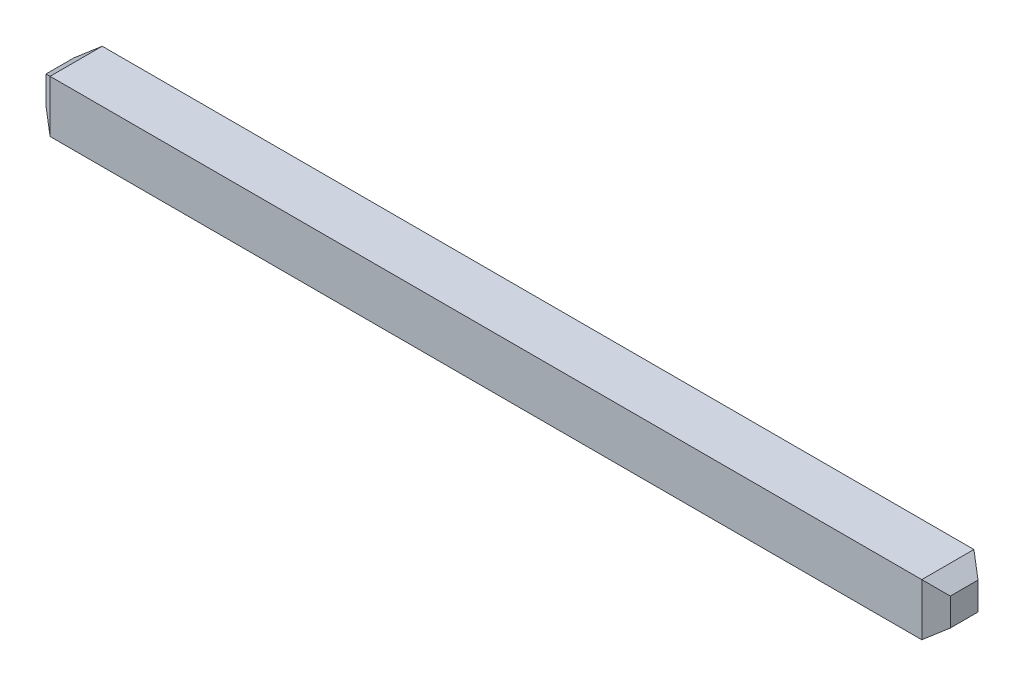
ISO-10303-21;
HEADER;
FILE_DESCRIPTION(('STEP AP214'),'2;1');
FILE_NAME('part.step','',(''),(''),'','','');
FILE_SCHEMA(('AUTOMOTIVE_DESIGN { 1 0 10303 214 1 1 1 1 }'));
ENDSEC;
DATA;
#1=APPLICATION_CONTEXT('core data for automotive mechanical design processes');
#2=APPLICATION_PROTOCOL_DEFINITION('international standard','automotive_design',2000,#1);
#3=PRODUCT_CONTEXT('',#1,'mechanical');
#4=PRODUCT('Part','Part','',(#3));
#5=PRODUCT_RELATED_PRODUCT_CATEGORY('part','',(#4));
#6=PRODUCT_DEFINITION_FORMATION('','',#4);
#7=PRODUCT_DEFINITION_CONTEXT('part definition',#1,'design');
#8=PRODUCT_DEFINITION('design','',#6,#7);
#9=PRODUCT_DEFINITION_SHAPE('','',#8);
#10=(LENGTH_UNIT() NAMED_UNIT(*) SI_UNIT(.MILLI.,.METRE.));
#11=(NAMED_UNIT(*) PLANE_ANGLE_UNIT() SI_UNIT($,.RADIAN.));
#12=(NAMED_UNIT(*) SI_UNIT($,.STERADIAN.) SOLID_ANGLE_UNIT());
#13=UNCERTAINTY_MEASURE_WITH_UNIT(LENGTH_MEASURE(1.E-05),#10,'distance_accuracy_value','');
#14=(GEOMETRIC_REPRESENTATION_CONTEXT(3) GLOBAL_UNCERTAINTY_ASSIGNED_CONTEXT((#13)) GLOBAL_UNIT_ASSIGNED_CONTEXT((#10,
#11,#12)) REPRESENTATION_CONTEXT('',''));
#15=CARTESIAN_POINT('',(0.,0.,0.));
#16=DIRECTION('',(0.,0.,1.));
#17=DIRECTION('',(1.,0.,0.));
#18=AXIS2_PLACEMENT_3D('',#15,#16,#17);
#19=CARTESIAN_POINT('',(-2.4,3.77,-29.455));
#20=DIRECTION('',(0.5999999999908,0.,0.8000000000069));
#21=DIRECTION('',(0.8000000000069,0.,-0.5999999999908));
#22=AXIS2_PLACEMENT_3D('',#19,#20,#21);
#23=PLANE('',#22);
#24=DIRECTION('',(0.,1.,0.));
#25=VECTOR('',#24,1.);
#26=CARTESIAN_POINT('',(-2.3,3.77,-29.53));
#27=LINE('',#26,#25);
#28=CARTESIAN_POINT('',(-2.29999999999957,4.09,-29.5299999999994));
#29=VERTEX_POINT('',#28);
#30=CARTESIAN_POINT('',(-2.29999999999957,3.45,-29.5299999999994));
#31=VERTEX_POINT('',#30);
#32=EDGE_CURVE('E101',#29,#31,#27,.F.);
#33=ORIENTED_EDGE('',*,*,#32,.T.);
#34=DIRECTION('',(-0.685994340570035,0.514495755427526,0.514495755427529));
#35=VECTOR('',#34,1.);
#36=CARTESIAN_POINT('',(-2.3,3.45,-29.53));
#37=LINE('',#36,#35);
#38=CARTESIAN_POINT('',(-2.50000000000022,3.6,-29.3800000000003));
#39=VERTEX_POINT('',#38);
#40=EDGE_CURVE('E85',#31,#39,#37,.T.);
#41=ORIENTED_EDGE('',*,*,#40,.T.);
#42=DIRECTION('',(0.,1.,0.));
#43=VECTOR('',#42,1.);
#44=CARTESIAN_POINT('',(-2.5,3.77,-29.38));
#45=LINE('',#44,#43);
#46=CARTESIAN_POINT('',(-2.50000000000043,3.94,-29.3800000000006));
#47=VERTEX_POINT('',#46);
#48=EDGE_CURVE('E79',#39,#47,#45,.T.);
#49=ORIENTED_EDGE('',*,*,#48,.T.);
#50=DIRECTION('',(-0.685994340570035,-0.514495755427526,0.514495755427529));
#51=VECTOR('',#50,1.);
#52=CARTESIAN_POINT('',(-2.3,4.09,-29.53));
#53=LINE('',#52,#51);
#54=EDGE_CURVE('E20',#29,#47,#53,.T.);
#55=ORIENTED_EDGE('',*,*,#54,.F.);
#56=EDGE_LOOP('',(#33,#41,#49,#55));
#57=FACE_BOUND('',#56,.T.);
#58=ADVANCED_FACE('F17',(#57),#23,.F.);
#59=CARTESIAN_POINT('',(8.5,3.77,-29.455));
#60=DIRECTION('',(-0.5999999999908,0.,0.8000000000069));
#61=DIRECTION('',(0.8000000000069,0.,0.5999999999908));
#62=AXIS2_PLACEMENT_3D('',#59,#60,#61);
#63=PLANE('',#62);
#64=DIRECTION('',(0.,1.,0.));
#65=VECTOR('',#64,1.);
#66=CARTESIAN_POINT('',(8.6,3.77,-29.38));
#67=LINE('',#66,#65);
#68=CARTESIAN_POINT('',(8.60000000000021,3.6,-29.3800000000003));
#69=VERTEX_POINT('',#68);
#70=CARTESIAN_POINT('',(8.60000000000043,3.94,-29.3800000000006));
#71=VERTEX_POINT('',#70);
#72=EDGE_CURVE('E113',#69,#71,#67,.T.);
#73=ORIENTED_EDGE('',*,*,#72,.F.);
#74=DIRECTION('',(-0.685994340570033,-0.514495755427525,-0.514495755427531));
#75=VECTOR('',#74,1.);
#76=CARTESIAN_POINT('',(8.6,3.6,-29.38));
#77=LINE('',#76,#75);
#78=CARTESIAN_POINT('',(8.39999999999957,3.45,-29.5299999999994));
#79=VERTEX_POINT('',#78);
#80=EDGE_CURVE('E108',#69,#79,#77,.T.);
#81=ORIENTED_EDGE('',*,*,#80,.T.);
#82=DIRECTION('',(0.,1.,0.));
#83=VECTOR('',#82,1.);
#84=CARTESIAN_POINT('',(8.4,3.77,-29.53));
#85=LINE('',#84,#83);
#86=CARTESIAN_POINT('',(8.39999999999957,4.09,-29.5299999999994));
#87=VERTEX_POINT('',#86);
#88=EDGE_CURVE('E99',#79,#87,#85,.T.);
#89=ORIENTED_EDGE('',*,*,#88,.T.);
#90=DIRECTION('',(-0.685994340570033,0.514495755427525,-0.514495755427531));
#91=VECTOR('',#90,1.);
#92=CARTESIAN_POINT('',(8.6,3.94,-29.38));
#93=LINE('',#92,#91);
#94=EDGE_CURVE('E116',#71,#87,#93,.T.);
#95=ORIENTED_EDGE('',*,*,#94,.F.);
#96=EDGE_LOOP('',(#73,#81,#89,#95));
#97=FACE_BOUND('',#96,.T.);
#98=ADVANCED_FACE('F214',(#97),#63,.F.);
#99=CARTESIAN_POINT('',(-2.4,4.015,-29.21));
#100=DIRECTION('',(-0.6,0.8,0.));
#101=DIRECTION('',(-0.8,-0.6,0.));
#102=AXIS2_PLACEMENT_3D('',#99,#100,#101);
#103=PLANE('',#102);
#104=DIRECTION('',(-0.685994340575992,-0.514495755427529,-0.514495755419582));
#105=VECTOR('',#104,1.);
#106=CARTESIAN_POINT('',(-2.29999999999913,4.09,-28.8900000000012));
#107=LINE('',#106,#105);
#108=CARTESIAN_POINT('',(-2.29999999999989,4.09,-28.8900000000001));
#109=VERTEX_POINT('',#108);
#110=CARTESIAN_POINT('',(-2.50000000000022,3.94,-29.0399999999997));
#111=VERTEX_POINT('',#110);
#112=EDGE_CURVE('E128',#109,#111,#107,.T.);
#113=ORIENTED_EDGE('',*,*,#112,.F.);
#114=DIRECTION('',(0.,0.,1.));
#115=VECTOR('',#114,1.);
#116=CARTESIAN_POINT('',(-2.3,4.09,-29.21));
#117=LINE('',#116,#115);
#118=EDGE_CURVE('E93',#29,#109,#117,.T.);
#119=ORIENTED_EDGE('',*,*,#118,.F.);
#120=ORIENTED_EDGE('',*,*,#54,.T.);
#121=DIRECTION('',(0.,0.,-1.));
#122=VECTOR('',#121,1.);
#123=CARTESIAN_POINT('',(-2.5,3.94,-29.21));
#124=LINE('',#123,#122);
#125=EDGE_CURVE('E87',#47,#111,#124,.F.);
#126=ORIENTED_EDGE('',*,*,#125,.T.);
#127=EDGE_LOOP('',(#113,#119,#120,#126));
#128=FACE_BOUND('',#127,.T.);
#129=ADVANCED_FACE('F90',(#128),#103,.T.);
#130=CARTESIAN_POINT('',(-2.5,3.77,-29.21));
#131=DIRECTION('',(1.,0.,0.));
#132=DIRECTION('',(0.,0.,-1.));
#133=AXIS2_PLACEMENT_3D('',#130,#131,#132);
#134=PLANE('',#133);
#135=DIRECTION('',(0.,1.,0.));
#136=VECTOR('',#135,1.);
#137=CARTESIAN_POINT('',(-2.50000000000087,3.77,-29.0399999999988));
#138=LINE('',#137,#136);
#139=CARTESIAN_POINT('',(-2.50000000000022,3.6,-29.0399999999997));
#140=VERTEX_POINT('',#139);
#141=EDGE_CURVE('E97',#111,#140,#138,.F.);
#142=ORIENTED_EDGE('',*,*,#141,.F.);
#143=ORIENTED_EDGE('',*,*,#125,.F.);
#144=ORIENTED_EDGE('',*,*,#48,.F.);
#145=DIRECTION('',(0.,0.,1.));
#146=VECTOR('',#145,1.);
#147=CARTESIAN_POINT('',(-2.5,3.6,-29.21));
#148=LINE('',#147,#146);
#149=EDGE_CURVE('E105',#39,#140,#148,.T.);
#150=ORIENTED_EDGE('',*,*,#149,.T.);
#151=EDGE_LOOP('',(#142,#143,#144,#150));
#152=FACE_BOUND('',#151,.T.);
#153=ADVANCED_FACE('F95',(#152),#134,.F.);
#154=CARTESIAN_POINT('',(3.05,3.77,-29.53));
#155=DIRECTION('',(0.,0.,1.));
#156=DIRECTION('',(1.,0.,0.));
#157=AXIS2_PLACEMENT_3D('',#154,#155,#156);
#158=PLANE('',#157);
#159=ORIENTED_EDGE('',*,*,#32,.F.);
#160=DIRECTION('',(1.,0.,0.));
#161=VECTOR('',#160,1.);
#162=CARTESIAN_POINT('',(3.05,4.09,-29.53));
#163=LINE('',#162,#161);
#164=EDGE_CURVE('E122',#87,#29,#163,.F.);
#165=ORIENTED_EDGE('',*,*,#164,.F.);
#166=ORIENTED_EDGE('',*,*,#88,.F.);
#167=DIRECTION('',(1.,0.,0.));
#168=VECTOR('',#167,1.);
#169=CARTESIAN_POINT('',(3.05,3.45,-29.53));
#170=LINE('',#169,#168);
#171=EDGE_CURVE('E136',#79,#31,#170,.F.);
#172=ORIENTED_EDGE('',*,*,#171,.T.);
#173=EDGE_LOOP('',(#159,#165,#166,#172));
#174=FACE_BOUND('',#173,.T.);
#175=ADVANCED_FACE('F182',(#174),#158,.F.);
#176=CARTESIAN_POINT('',(-2.4,3.525,-29.21));
#177=DIRECTION('',(0.6,0.8,0.));
#178=DIRECTION('',(-0.8,0.6,0.));
#179=AXIS2_PLACEMENT_3D('',#176,#177,#178);
#180=PLANE('',#179);
#181=DIRECTION('',(0.,0.,1.));
#182=VECTOR('',#181,1.);
#183=CARTESIAN_POINT('',(-2.3,3.45,-29.21));
#184=LINE('',#183,#182);
#185=CARTESIAN_POINT('',(-2.29999999999978,3.45,-28.8900000000003));
#186=VERTEX_POINT('',#185);
#187=EDGE_CURVE('E139',#31,#186,#184,.T.);
#188=ORIENTED_EDGE('',*,*,#187,.T.);
#189=DIRECTION('',(0.685994340575992,-0.514495755427529,0.514495755419582));
#190=VECTOR('',#189,1.);
#191=CARTESIAN_POINT('',(-2.50000000000087,3.6,-29.0399999999988));
#192=LINE('',#191,#190);
#193=EDGE_CURVE('E131',#140,#186,#192,.T.);
#194=ORIENTED_EDGE('',*,*,#193,.F.);
#195=ORIENTED_EDGE('',*,*,#149,.F.);
#196=ORIENTED_EDGE('',*,*,#40,.F.);
#197=EDGE_LOOP('',(#188,#194,#195,#196));
#198=FACE_BOUND('',#197,.T.);
#199=ADVANCED_FACE('F179',(#198),#180,.F.);
#200=CARTESIAN_POINT('',(8.5,3.525,-29.21));
#201=DIRECTION('',(-0.6,0.8,0.));
#202=DIRECTION('',(-0.8,-0.6,0.));
#203=AXIS2_PLACEMENT_3D('',#200,#201,#202);
#204=PLANE('',#203);
#205=DIRECTION('',(0.,0.,-1.));
#206=VECTOR('',#205,1.);
#207=CARTESIAN_POINT('',(8.6,3.6,-29.21));
#208=LINE('',#207,#206);
#209=CARTESIAN_POINT('',(8.60000000000022,3.6,-29.0399999999997));
#210=VERTEX_POINT('',#209);
#211=EDGE_CURVE('E110',#210,#69,#208,.T.);
#212=ORIENTED_EDGE('',*,*,#211,.F.);
#213=DIRECTION('',(0.685994340575992,0.514495755427534,-0.514495755419576));
#214=VECTOR('',#213,1.);
#215=CARTESIAN_POINT('',(8.39999999999913,3.45,-28.8900000000012));
#216=LINE('',#215,#214);
#217=CARTESIAN_POINT('',(8.39999999999989,3.45,-28.8900000000001));
#218=VERTEX_POINT('',#217);
#219=EDGE_CURVE('E35',#218,#210,#216,.T.);
#220=ORIENTED_EDGE('',*,*,#219,.F.);
#221=DIRECTION('',(0.,0.,1.));
#222=VECTOR('',#221,1.);
#223=CARTESIAN_POINT('',(8.4,3.45,-29.21));
#224=LINE('',#223,#222);
#225=EDGE_CURVE('E134',#218,#79,#224,.F.);
#226=ORIENTED_EDGE('',*,*,#225,.T.);
#227=ORIENTED_EDGE('',*,*,#80,.F.);
#228=EDGE_LOOP('',(#212,#220,#226,#227));
#229=FACE_BOUND('',#228,.T.);
#230=ADVANCED_FACE('F181',(#229),#204,.F.);
#231=CARTESIAN_POINT('',(8.6,3.77,-29.21));
#232=DIRECTION('',(1.,0.,0.));
#233=DIRECTION('',(0.,0.,-1.));
#234=AXIS2_PLACEMENT_3D('',#231,#232,#233);
#235=PLANE('',#234);
#236=ORIENTED_EDGE('',*,*,#72,.T.);
#237=DIRECTION('',(0.,0.,1.));
#238=VECTOR('',#237,1.);
#239=CARTESIAN_POINT('',(8.6,3.94,-29.21));
#240=LINE('',#239,#238);
#241=CARTESIAN_POINT('',(8.60000000000022,3.94,-29.0399999999997));
#242=VERTEX_POINT('',#241);
#243=EDGE_CURVE('E119',#242,#71,#240,.F.);
#244=ORIENTED_EDGE('',*,*,#243,.F.);
#245=DIRECTION('',(0.,1.,0.));
#246=VECTOR('',#245,1.);
#247=CARTESIAN_POINT('',(8.60000000000087,3.77,-29.0399999999988));
#248=LINE('',#247,#246);
#249=EDGE_CURVE('E142',#210,#242,#248,.T.);
#250=ORIENTED_EDGE('',*,*,#249,.F.);
#251=ORIENTED_EDGE('',*,*,#211,.T.);
#252=EDGE_LOOP('',(#236,#244,#250,#251));
#253=FACE_BOUND('',#252,.T.);
#254=ADVANCED_FACE('F189',(#253),#235,.T.);
#255=CARTESIAN_POINT('',(8.5,4.015,-29.21));
#256=DIRECTION('',(0.6,0.8,0.));
#257=DIRECTION('',(-0.8,0.6,0.));
#258=AXIS2_PLACEMENT_3D('',#255,#256,#257);
#259=PLANE('',#258);
#260=DIRECTION('',(-0.685994340575992,0.514495755427534,0.514495755419576));
#261=VECTOR('',#260,1.);
#262=CARTESIAN_POINT('',(8.60000000000087,3.94,-29.0399999999988));
#263=LINE('',#262,#261);
#264=CARTESIAN_POINT('',(8.39999999999989,4.09,-28.8900000000001));
#265=VERTEX_POINT('',#264);
#266=EDGE_CURVE('E145',#242,#265,#263,.T.);
#267=ORIENTED_EDGE('',*,*,#266,.F.);
#268=ORIENTED_EDGE('',*,*,#243,.T.);
#269=ORIENTED_EDGE('',*,*,#94,.T.);
#270=DIRECTION('',(0.,0.,1.));
#271=VECTOR('',#270,1.);
#272=CARTESIAN_POINT('',(8.4,4.09,-29.21));
#273=LINE('',#272,#271);
#274=EDGE_CURVE('E125',#265,#87,#273,.F.);
#275=ORIENTED_EDGE('',*,*,#274,.F.);
#276=EDGE_LOOP('',(#267,#268,#269,#275));
#277=FACE_BOUND('',#276,.T.);
#278=ADVANCED_FACE('F170',(#277),#259,.T.);
#279=CARTESIAN_POINT('',(3.05,4.09,-29.21));
#280=DIRECTION('',(0.,1.,0.));
#281=DIRECTION('',(0.,0.,1.));
#282=AXIS2_PLACEMENT_3D('',#279,#280,#281);
#283=PLANE('',#282);
#284=DIRECTION('',(1.,0.,0.));
#285=VECTOR('',#284,1.);
#286=CARTESIAN_POINT('',(3.05,4.09,-28.89));
#287=LINE('',#286,#285);
#288=EDGE_CURVE('E148',#265,#109,#287,.F.);
#289=ORIENTED_EDGE('',*,*,#288,.F.);
#290=ORIENTED_EDGE('',*,*,#274,.T.);
#291=ORIENTED_EDGE('',*,*,#164,.T.);
#292=ORIENTED_EDGE('',*,*,#118,.T.);
#293=EDGE_LOOP('',(#289,#290,#291,#292));
#294=FACE_BOUND('',#293,.T.);
#295=ADVANCED_FACE('F173',(#294),#283,.T.);
#296=CARTESIAN_POINT('',(-2.4,3.77,-28.965));
#297=DIRECTION('',(-0.599999999990736,0.,0.800000000006948));
#298=DIRECTION('',(0.800000000006948,0.,0.599999999990736));
#299=AXIS2_PLACEMENT_3D('',#296,#297,#298);
#300=PLANE('',#299);
#301=ORIENTED_EDGE('',*,*,#193,.T.);
#302=DIRECTION('',(0.,1.,0.));
#303=VECTOR('',#302,1.);
#304=CARTESIAN_POINT('',(-2.3,3.77,-28.89));
#305=LINE('',#304,#303);
#306=EDGE_CURVE('E151',#109,#186,#305,.F.);
#307=ORIENTED_EDGE('',*,*,#306,.F.);
#308=ORIENTED_EDGE('',*,*,#112,.T.);
#309=ORIENTED_EDGE('',*,*,#141,.T.);
#310=EDGE_LOOP('',(#301,#307,#308,#309));
#311=FACE_BOUND('',#310,.T.);
#312=ADVANCED_FACE('F176',(#311),#300,.T.);
#313=CARTESIAN_POINT('',(3.05,3.45,-29.21));
#314=DIRECTION('',(0.,1.,0.));
#315=DIRECTION('',(0.,0.,1.));
#316=AXIS2_PLACEMENT_3D('',#313,#314,#315);
#317=PLANE('',#316);
#318=ORIENTED_EDGE('',*,*,#187,.F.);
#319=ORIENTED_EDGE('',*,*,#171,.F.);
#320=ORIENTED_EDGE('',*,*,#225,.F.);
#321=DIRECTION('',(1.,0.,0.));
#322=VECTOR('',#321,1.);
#323=CARTESIAN_POINT('',(3.05,3.45,-28.89));
#324=LINE('',#323,#322);
#325=EDGE_CURVE('E26',#186,#218,#324,.T.);
#326=ORIENTED_EDGE('',*,*,#325,.F.);
#327=EDGE_LOOP('',(#318,#319,#320,#326));
#328=FACE_BOUND('',#327,.T.);
#329=ADVANCED_FACE('F162',(#328),#317,.F.);
#330=CARTESIAN_POINT('',(8.5,3.77,-28.965));
#331=DIRECTION('',(0.599999999990736,0.,0.800000000006948));
#332=DIRECTION('',(0.800000000006948,0.,-0.599999999990736));
#333=AXIS2_PLACEMENT_3D('',#330,#331,#332);
#334=PLANE('',#333);
#335=ORIENTED_EDGE('',*,*,#266,.T.);
#336=DIRECTION('',(0.,1.,0.));
#337=VECTOR('',#336,1.);
#338=CARTESIAN_POINT('',(8.4,3.77,-28.89));
#339=LINE('',#338,#337);
#340=EDGE_CURVE('E11',#218,#265,#339,.T.);
#341=ORIENTED_EDGE('',*,*,#340,.F.);
#342=ORIENTED_EDGE('',*,*,#219,.T.);
#343=ORIENTED_EDGE('',*,*,#249,.T.);
#344=EDGE_LOOP('',(#335,#341,#342,#343));
#345=FACE_BOUND('',#344,.T.);
#346=ADVANCED_FACE('F166',(#345),#334,.T.);
#347=CARTESIAN_POINT('',(3.05,3.77,-28.89));
#348=DIRECTION('',(0.,0.,1.));
#349=DIRECTION('',(1.,0.,0.));
#350=AXIS2_PLACEMENT_3D('',#347,#348,#349);
#351=PLANE('',#350);
#352=ORIENTED_EDGE('',*,*,#325,.T.);
#353=ORIENTED_EDGE('',*,*,#340,.T.);
#354=ORIENTED_EDGE('',*,*,#288,.T.);
#355=ORIENTED_EDGE('',*,*,#306,.T.);
#356=EDGE_LOOP('',(#352,#353,#354,#355));
#357=FACE_BOUND('',#356,.T.);
#358=ADVANCED_FACE('F157',(#357),#351,.T.);
#359=CLOSED_SHELL('',(#58,#98,#129,#153,#175,#199,#230,#254,#278,#295,#312,#329,#346,#358));
#360=MANIFOLD_SOLID_BREP('B1',#359);
#361=ADVANCED_BREP_SHAPE_REPRESENTATION('',(#18,#360),#14);
#362=SHAPE_DEFINITION_REPRESENTATION(#9,#361);
ENDSEC;
END-ISO-10303-21;
